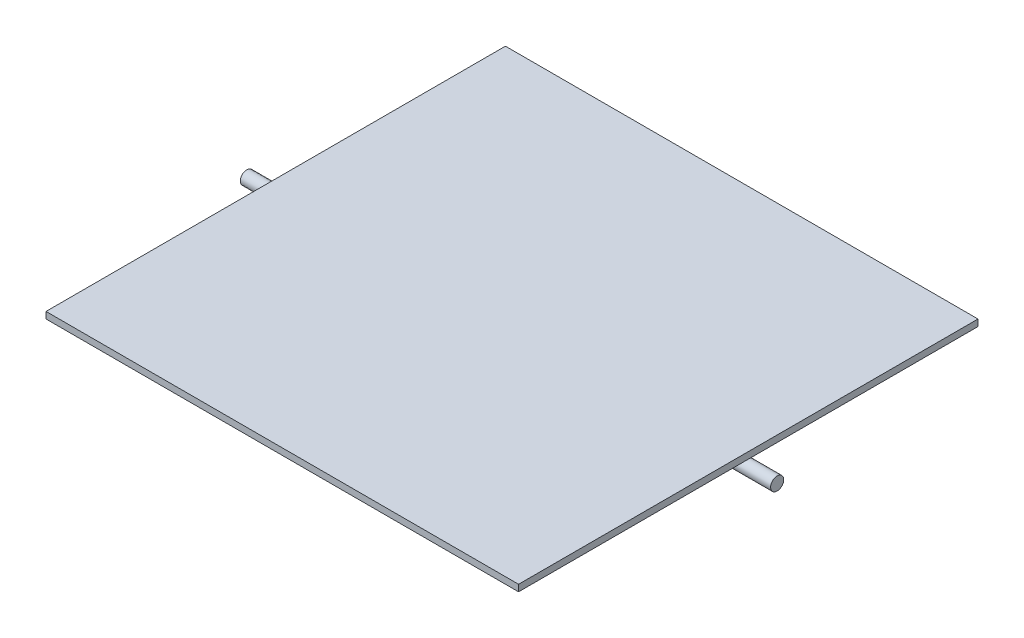
ISO-10303-21;
HEADER;
FILE_DESCRIPTION(('STEP AP214'),'2;1');
FILE_NAME('part.step','',(''),(''),'','','');
FILE_SCHEMA(('AUTOMOTIVE_DESIGN { 1 0 10303 214 1 1 1 1 }'));
ENDSEC;
DATA;
#1=APPLICATION_CONTEXT('core data for automotive mechanical design processes');
#2=APPLICATION_PROTOCOL_DEFINITION('international standard','automotive_design',2000,#1);
#3=PRODUCT_CONTEXT('',#1,'mechanical');
#4=PRODUCT('Part','Part','',(#3));
#5=PRODUCT_RELATED_PRODUCT_CATEGORY('part','',(#4));
#6=PRODUCT_DEFINITION_FORMATION('','',#4);
#7=PRODUCT_DEFINITION_CONTEXT('part definition',#1,'design');
#8=PRODUCT_DEFINITION('design','',#6,#7);
#9=PRODUCT_DEFINITION_SHAPE('','',#8);
#10=(LENGTH_UNIT() NAMED_UNIT(*) SI_UNIT(.MILLI.,.METRE.));
#11=(NAMED_UNIT(*) PLANE_ANGLE_UNIT() SI_UNIT($,.RADIAN.));
#12=(NAMED_UNIT(*) SI_UNIT($,.STERADIAN.) SOLID_ANGLE_UNIT());
#13=UNCERTAINTY_MEASURE_WITH_UNIT(LENGTH_MEASURE(1.E-05),#10,'distance_accuracy_value','');
#14=(GEOMETRIC_REPRESENTATION_CONTEXT(3) GLOBAL_UNCERTAINTY_ASSIGNED_CONTEXT((#13)) GLOBAL_UNIT_ASSIGNED_CONTEXT((#10,
#11,#12)) REPRESENTATION_CONTEXT('',''));
#15=CARTESIAN_POINT('',(0.,0.,0.));
#16=DIRECTION('',(0.,0.,1.));
#17=DIRECTION('',(1.,0.,0.));
#18=AXIS2_PLACEMENT_3D('',#15,#16,#17);
#19=CARTESIAN_POINT('',(202.,-5.,0.));
#20=DIRECTION('',(-1.,0.,0.));
#21=DIRECTION('',(0.,0.,1.));
#22=AXIS2_PLACEMENT_3D('',#19,#20,#21);
#23=CYLINDRICAL_SURFACE('',#22,5.);
#24=CARTESIAN_POINT('',(202.,-5.,0.));
#25=DIRECTION('',(1.,0.,0.));
#26=DIRECTION('',(0.,0.,-1.));
#27=AXIS2_PLACEMENT_3D('',#24,#25,#26);
#28=CIRCLE('',#27,5.);
#29=CARTESIAN_POINT('',(202.,-5.,-5.));
#30=VERTEX_POINT('',#29);
#31=EDGE_CURVE('E11',#30,#30,#28,.T.);
#32=ORIENTED_EDGE('',*,*,#31,.F.);
#33=EDGE_LOOP('',(#32));
#34=FACE_BOUND('',#33,.T.);
#35=CARTESIAN_POINT('',(-202.,-5.,0.));
#36=DIRECTION('',(1.,0.,0.));
#37=DIRECTION('',(0.,0.,-1.));
#38=AXIS2_PLACEMENT_3D('',#35,#36,#37);
#39=CIRCLE('',#38,5.);
#40=CARTESIAN_POINT('',(-202.,-5.,-5.));
#41=VERTEX_POINT('',#40);
#42=EDGE_CURVE('E43',#41,#41,#39,.T.);
#43=ORIENTED_EDGE('',*,*,#42,.T.);
#44=EDGE_LOOP('',(#43));
#45=FACE_BOUND('',#44,.T.);
#46=ADVANCED_FACE('F40',(#34,#45),#23,.T.);
#47=CARTESIAN_POINT('',(202.,-5.,0.));
#48=DIRECTION('',(1.,0.,0.));
#49=DIRECTION('',(0.,0.,-1.));
#50=AXIS2_PLACEMENT_3D('',#47,#48,#49);
#51=PLANE('',#50);
#52=ORIENTED_EDGE('',*,*,#31,.T.);
#53=EDGE_LOOP('',(#52));
#54=FACE_BOUND('',#53,.T.);
#55=ADVANCED_FACE('F55',(#54),#51,.T.);
#56=CARTESIAN_POINT('',(-202.,-5.,0.));
#57=DIRECTION('',(1.,0.,0.));
#58=DIRECTION('',(0.,0.,-1.));
#59=AXIS2_PLACEMENT_3D('',#56,#57,#58);
#60=PLANE('',#59);
#61=ORIENTED_EDGE('',*,*,#42,.F.);
#62=EDGE_LOOP('',(#61));
#63=FACE_BOUND('',#62,.T.);
#64=ADVANCED_FACE('F53',(#63),#60,.F.);
#65=CLOSED_SHELL('',(#46,#55,#64));
#66=MANIFOLD_SOLID_BREP('B2',#65);
#67=CARTESIAN_POINT('',(-180.,5.,-175.));
#68=DIRECTION('',(1.,0.,0.));
#69=DIRECTION('',(0.,0.,-1.));
#70=AXIS2_PLACEMENT_3D('',#67,#68,#69);
#71=PLANE('',#70);
#72=DIRECTION('',(0.,0.,1.));
#73=VECTOR('',#72,1.);
#74=CARTESIAN_POINT('',(-180.,0.,-175.));
#75=LINE('',#74,#73);
#76=CARTESIAN_POINT('',(-180.,0.,-175.));
#77=VERTEX_POINT('',#76);
#78=CARTESIAN_POINT('',(-180.,0.,175.));
#79=VERTEX_POINT('',#78);
#80=EDGE_CURVE('E144',#77,#79,#75,.T.);
#81=ORIENTED_EDGE('',*,*,#80,.T.);
#82=DIRECTION('',(0.,-1.,0.));
#83=VECTOR('',#82,1.);
#84=CARTESIAN_POINT('',(-180.,5.,175.));
#85=LINE('',#84,#83);
#86=CARTESIAN_POINT('',(-180.,5.,175.));
#87=VERTEX_POINT('',#86);
#88=EDGE_CURVE('E38',#87,#79,#85,.T.);
#89=ORIENTED_EDGE('',*,*,#88,.F.);
#90=DIRECTION('',(0.,0.,1.));
#91=VECTOR('',#90,1.);
#92=CARTESIAN_POINT('',(-180.,5.,-175.));
#93=LINE('',#92,#91);
#94=CARTESIAN_POINT('',(-180.,5.,-175.));
#95=VERTEX_POINT('',#94);
#96=EDGE_CURVE('E131',#95,#87,#93,.T.);
#97=ORIENTED_EDGE('',*,*,#96,.F.);
#98=DIRECTION('',(0.,-1.,0.));
#99=VECTOR('',#98,1.);
#100=CARTESIAN_POINT('',(-180.,5.,-175.));
#101=LINE('',#100,#99);
#102=EDGE_CURVE('E140',#95,#77,#101,.T.);
#103=ORIENTED_EDGE('',*,*,#102,.T.);
#104=EDGE_LOOP('',(#81,#89,#97,#103));
#105=FACE_BOUND('',#104,.T.);
#106=ADVANCED_FACE('F80',(#105),#71,.F.);
#107=CARTESIAN_POINT('',(-180.,5.,175.));
#108=DIRECTION('',(0.,0.,-1.));
#109=DIRECTION('',(-1.,0.,0.));
#110=AXIS2_PLACEMENT_3D('',#107,#108,#109);
#111=PLANE('',#110);
#112=DIRECTION('',(1.,0.,0.));
#113=VECTOR('',#112,1.);
#114=CARTESIAN_POINT('',(-180.,0.,175.));
#115=LINE('',#114,#113);
#116=CARTESIAN_POINT('',(180.,0.,175.));
#117=VERTEX_POINT('',#116);
#118=EDGE_CURVE('E136',#79,#117,#115,.T.);
#119=ORIENTED_EDGE('',*,*,#118,.T.);
#120=DIRECTION('',(0.,-1.,0.));
#121=VECTOR('',#120,1.);
#122=CARTESIAN_POINT('',(180.,5.,175.));
#123=LINE('',#122,#121);
#124=CARTESIAN_POINT('',(180.,5.,175.));
#125=VERTEX_POINT('',#124);
#126=EDGE_CURVE('E88',#125,#117,#123,.T.);
#127=ORIENTED_EDGE('',*,*,#126,.F.);
#128=DIRECTION('',(1.,0.,0.));
#129=VECTOR('',#128,1.);
#130=CARTESIAN_POINT('',(-180.,5.,175.));
#131=LINE('',#130,#129);
#132=EDGE_CURVE('E126',#87,#125,#131,.T.);
#133=ORIENTED_EDGE('',*,*,#132,.F.);
#134=ORIENTED_EDGE('',*,*,#88,.T.);
#135=EDGE_LOOP('',(#119,#127,#133,#134));
#136=FACE_BOUND('',#135,.T.);
#137=ADVANCED_FACE('F134',(#136),#111,.F.);
#138=CARTESIAN_POINT('',(180.,5.,-175.));
#139=DIRECTION('',(-1.,0.,0.));
#140=DIRECTION('',(0.,0.,1.));
#141=AXIS2_PLACEMENT_3D('',#138,#139,#140);
#142=PLANE('',#141);
#143=DIRECTION('',(0.,0.,-1.));
#144=VECTOR('',#143,1.);
#145=CARTESIAN_POINT('',(180.,0.,-175.));
#146=LINE('',#145,#144);
#147=CARTESIAN_POINT('',(180.,0.,-175.));
#148=VERTEX_POINT('',#147);
#149=EDGE_CURVE('E113',#117,#148,#146,.T.);
#150=ORIENTED_EDGE('',*,*,#149,.T.);
#151=DIRECTION('',(0.,-1.,0.));
#152=VECTOR('',#151,1.);
#153=CARTESIAN_POINT('',(180.,5.,-175.));
#154=LINE('',#153,#152);
#155=CARTESIAN_POINT('',(180.,5.,-175.));
#156=VERTEX_POINT('',#155);
#157=EDGE_CURVE('E137',#156,#148,#154,.T.);
#158=ORIENTED_EDGE('',*,*,#157,.F.);
#159=DIRECTION('',(0.,0.,-1.));
#160=VECTOR('',#159,1.);
#161=CARTESIAN_POINT('',(180.,5.,-175.));
#162=LINE('',#161,#160);
#163=EDGE_CURVE('E129',#125,#156,#162,.T.);
#164=ORIENTED_EDGE('',*,*,#163,.F.);
#165=ORIENTED_EDGE('',*,*,#126,.T.);
#166=EDGE_LOOP('',(#150,#158,#164,#165));
#167=FACE_BOUND('',#166,.T.);
#168=ADVANCED_FACE('F138',(#167),#142,.F.);
#169=CARTESIAN_POINT('',(-180.,5.,-175.));
#170=DIRECTION('',(0.,0.,1.));
#171=DIRECTION('',(1.,0.,0.));
#172=AXIS2_PLACEMENT_3D('',#169,#170,#171);
#173=PLANE('',#172);
#174=DIRECTION('',(-1.,0.,0.));
#175=VECTOR('',#174,1.);
#176=CARTESIAN_POINT('',(-180.,0.,-175.));
#177=LINE('',#176,#175);
#178=EDGE_CURVE('E119',#148,#77,#177,.T.);
#179=ORIENTED_EDGE('',*,*,#178,.T.);
#180=ORIENTED_EDGE('',*,*,#102,.F.);
#181=DIRECTION('',(-1.,0.,0.));
#182=VECTOR('',#181,1.);
#183=CARTESIAN_POINT('',(-180.,5.,-175.));
#184=LINE('',#183,#182);
#185=EDGE_CURVE('E96',#156,#95,#184,.T.);
#186=ORIENTED_EDGE('',*,*,#185,.F.);
#187=ORIENTED_EDGE('',*,*,#157,.T.);
#188=EDGE_LOOP('',(#179,#180,#186,#187));
#189=FACE_BOUND('',#188,.T.);
#190=ADVANCED_FACE('F150',(#189),#173,.F.);
#191=CARTESIAN_POINT('',(0.,5.,0.));
#192=DIRECTION('',(0.,1.,0.));
#193=DIRECTION('',(0.,0.,1.));
#194=AXIS2_PLACEMENT_3D('',#191,#192,#193);
#195=PLANE('',#194);
#196=ORIENTED_EDGE('',*,*,#96,.T.);
#197=ORIENTED_EDGE('',*,*,#132,.T.);
#198=ORIENTED_EDGE('',*,*,#163,.T.);
#199=ORIENTED_EDGE('',*,*,#185,.T.);
#200=EDGE_LOOP('',(#196,#197,#198,#199));
#201=FACE_BOUND('',#200,.T.);
#202=ADVANCED_FACE('F127',(#201),#195,.T.);
#203=CARTESIAN_POINT('',(0.,0.,0.));
#204=DIRECTION('',(0.,1.,0.));
#205=DIRECTION('',(0.,0.,1.));
#206=AXIS2_PLACEMENT_3D('',#203,#204,#205);
#207=PLANE('',#206);
#208=ORIENTED_EDGE('',*,*,#118,.F.);
#209=ORIENTED_EDGE('',*,*,#80,.F.);
#210=ORIENTED_EDGE('',*,*,#178,.F.);
#211=ORIENTED_EDGE('',*,*,#149,.F.);
#212=EDGE_LOOP('',(#208,#209,#210,#211));
#213=FACE_BOUND('',#212,.T.);
#214=ADVANCED_FACE('F153',(#213),#207,.F.);
#215=CLOSED_SHELL('',(#106,#137,#168,#190,#202,#214));
#216=MANIFOLD_SOLID_BREP('B6',#215);
#217=ADVANCED_BREP_SHAPE_REPRESENTATION('',(#18,#66,#216),#14);
#218=SHAPE_DEFINITION_REPRESENTATION(#9,#217);
ENDSEC;
END-ISO-10303-21;
